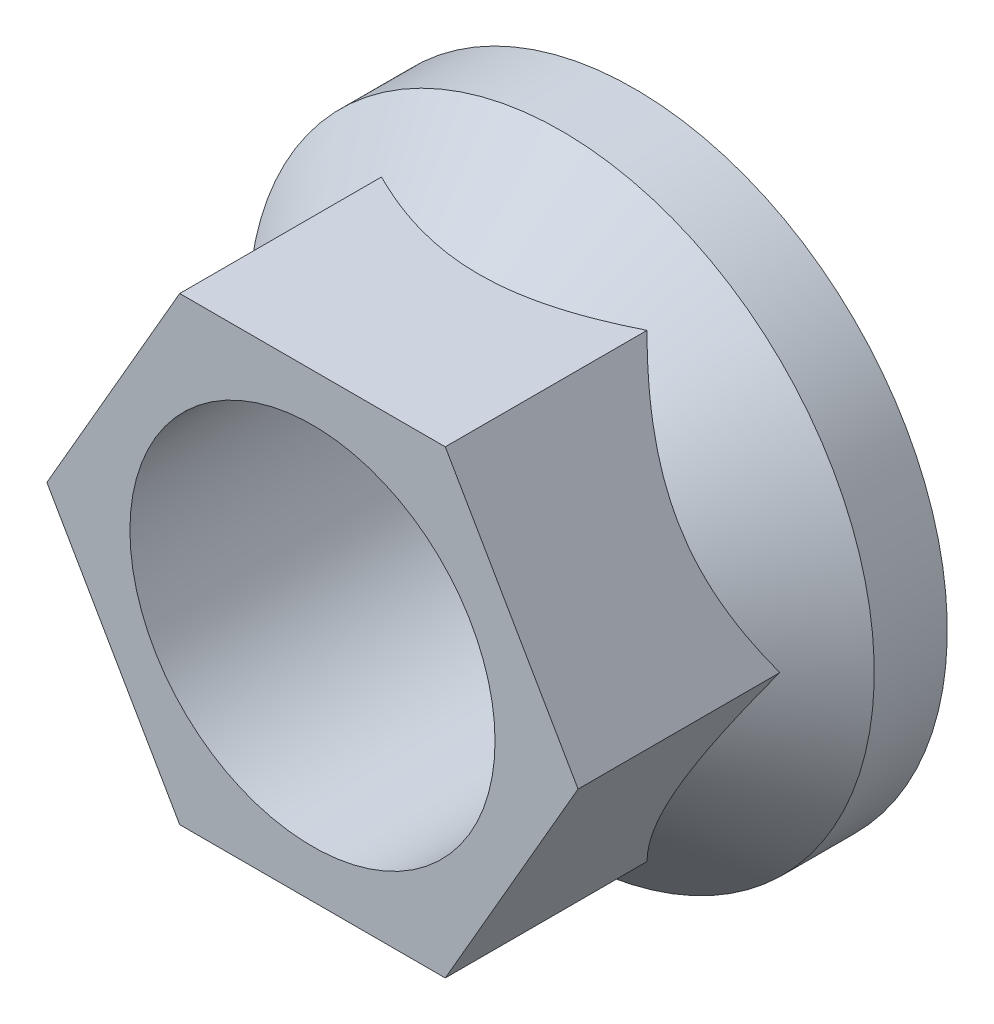
ISO-10303-21;
HEADER;
FILE_DESCRIPTION(('STEP AP214'),'2;1');
FILE_NAME('part.step','',(''),(''),'','','');
FILE_SCHEMA(('AUTOMOTIVE_DESIGN { 1 0 10303 214 1 1 1 1 }'));
ENDSEC;
DATA;
#1=APPLICATION_CONTEXT('core data for automotive mechanical design processes');
#2=APPLICATION_PROTOCOL_DEFINITION('international standard','automotive_design',2000,#1);
#3=PRODUCT_CONTEXT('',#1,'mechanical');
#4=PRODUCT('Part','Part','',(#3));
#5=PRODUCT_RELATED_PRODUCT_CATEGORY('part','',(#4));
#6=PRODUCT_DEFINITION_FORMATION('','',#4);
#7=PRODUCT_DEFINITION_CONTEXT('part definition',#1,'design');
#8=PRODUCT_DEFINITION('design','',#6,#7);
#9=PRODUCT_DEFINITION_SHAPE('','',#8);
#10=(LENGTH_UNIT() NAMED_UNIT(*) SI_UNIT(.MILLI.,.METRE.));
#11=(NAMED_UNIT(*) PLANE_ANGLE_UNIT() SI_UNIT($,.RADIAN.));
#12=(NAMED_UNIT(*) SI_UNIT($,.STERADIAN.) SOLID_ANGLE_UNIT());
#13=UNCERTAINTY_MEASURE_WITH_UNIT(LENGTH_MEASURE(1.E-05),#10,'distance_accuracy_value','');
#14=(GEOMETRIC_REPRESENTATION_CONTEXT(3) GLOBAL_UNCERTAINTY_ASSIGNED_CONTEXT((#13)) GLOBAL_UNIT_ASSIGNED_CONTEXT((#10,
#11,#12)) REPRESENTATION_CONTEXT('',''));
#15=CARTESIAN_POINT('',(0.,0.,0.));
#16=DIRECTION('',(0.,0.,1.));
#17=DIRECTION('',(1.,0.,0.));
#18=AXIS2_PLACEMENT_3D('',#15,#16,#17);
#19=CARTESIAN_POINT('',(0.,3.96875,7.));
#20=DIRECTION('',(0.,0.,1.));
#21=DIRECTION('',(1.,0.,0.));
#22=AXIS2_PLACEMENT_3D('',#19,#20,#21);
#23=PLANE('',#22);
#24=CARTESIAN_POINT('',(0.,0.,7.));
#25=DIRECTION('',(0.,0.,-1.));
#26=DIRECTION('',(-1.,0.,0.));
#27=AXIS2_PLACEMENT_3D('',#24,#25,#26);
#28=CIRCLE('',#27,3.96875);
#29=CARTESIAN_POINT('',(-3.96875,0.,7.));
#30=VERTEX_POINT('',#29);
#31=EDGE_CURVE('E136',#30,#30,#28,.T.);
#32=ORIENTED_EDGE('',*,*,#31,.T.);
#33=EDGE_LOOP('',(#32));
#34=FACE_BOUND('',#33,.T.);
#35=DIRECTION('',(-1.,0.,0.));
#36=VECTOR('',#35,1.);
#37=CARTESIAN_POINT('',(2.88675134594813,5.,7.));
#38=LINE('',#37,#36);
#39=CARTESIAN_POINT('',(2.88675134594813,5.,7.));
#40=VERTEX_POINT('',#39);
#41=CARTESIAN_POINT('',(-2.88675134594813,5.,7.));
#42=VERTEX_POINT('',#41);
#43=EDGE_CURVE('E92',#40,#42,#38,.T.);
#44=ORIENTED_EDGE('',*,*,#43,.T.);
#45=DIRECTION('',(-0.5,-0.866025403784439,0.));
#46=VECTOR('',#45,1.);
#47=CARTESIAN_POINT('',(-2.88675134594813,5.,7.));
#48=LINE('',#47,#46);
#49=CARTESIAN_POINT('',(-5.77350269189626,0.,7.));
#50=VERTEX_POINT('',#49);
#51=EDGE_CURVE('E101',#42,#50,#48,.T.);
#52=ORIENTED_EDGE('',*,*,#51,.T.);
#53=DIRECTION('',(0.5,-0.866025403784439,0.));
#54=VECTOR('',#53,1.);
#55=CARTESIAN_POINT('',(-5.77350269189626,0.,7.));
#56=LINE('',#55,#54);
#57=CARTESIAN_POINT('',(-2.88675134594813,-5.,7.));
#58=VERTEX_POINT('',#57);
#59=EDGE_CURVE('E106',#50,#58,#56,.T.);
#60=ORIENTED_EDGE('',*,*,#59,.T.);
#61=DIRECTION('',(1.,0.,0.));
#62=VECTOR('',#61,1.);
#63=CARTESIAN_POINT('',(-2.88675134594813,-5.,7.));
#64=LINE('',#63,#62);
#65=CARTESIAN_POINT('',(2.88675134594813,-5.,7.));
#66=VERTEX_POINT('',#65);
#67=EDGE_CURVE('E121',#58,#66,#64,.T.);
#68=ORIENTED_EDGE('',*,*,#67,.T.);
#69=DIRECTION('',(0.5,0.866025403784439,0.));
#70=VECTOR('',#69,1.);
#71=CARTESIAN_POINT('',(2.88675134594813,-5.,7.));
#72=LINE('',#71,#70);
#73=CARTESIAN_POINT('',(5.77350269189626,0.,7.));
#74=VERTEX_POINT('',#73);
#75=EDGE_CURVE('E124',#66,#74,#72,.T.);
#76=ORIENTED_EDGE('',*,*,#75,.T.);
#77=DIRECTION('',(-0.5,0.866025403784439,0.));
#78=VECTOR('',#77,1.);
#79=CARTESIAN_POINT('',(5.77350269189626,0.,7.));
#80=LINE('',#79,#78);
#81=EDGE_CURVE('E98',#74,#40,#80,.T.);
#82=ORIENTED_EDGE('',*,*,#81,.T.);
#83=EDGE_LOOP('',(#44,#52,#60,#68,#76,#82));
#84=FACE_BOUND('',#83,.T.);
#85=ADVANCED_FACE('F36',(#34,#84),#23,.T.);
#86=CARTESIAN_POINT('',(0.,0.,1.5875));
#87=DIRECTION('',(0.,0.,-1.));
#88=DIRECTION('',(-1.,0.,0.));
#89=AXIS2_PLACEMENT_3D('',#86,#87,#88);
#90=CONICAL_SURFACE('',#89,6.8,0.78539816339745);
#91=CARTESIAN_POINT('',(-5.7736181619501,-0.00019999999999992,2.61388183458587));
#92=CARTESIAN_POINT('',(-5.72398176110226,0.0857727681733075,2.66351376249948));
#93=CARTESIAN_POINT('',(-5.6739638280717,0.172406369471809,2.71162258281683));
#94=CARTESIAN_POINT('',(-5.57309004377304,0.34712488902884,2.80433067677396));
#95=CARTESIAN_POINT('',(-5.5222337529357,0.43521056864361,2.84892803360225));
#96=CARTESIAN_POINT('',(-5.367822577439,0.702658569860331,2.97713823597548));
#97=CARTESIAN_POINT('',(-5.26296050943972,0.88428499942183,3.05462224260221));
#98=CARTESIAN_POINT('',(-5.05149774994706,1.25054924277183,3.18730836367822));
#99=CARTESIAN_POINT('',(-4.94495110937142,1.43509343762461,3.2428447674579));
#100=CARTESIAN_POINT('',(-4.78337944338746,1.71494377217238,3.30708681405622));
#101=CARTESIAN_POINT('',(-4.72928433986568,1.8086392399128,3.3253151447651));
#102=CARTESIAN_POINT('',(-4.6206360917956,1.99682352572354,3.35500512097761));
#103=CARTESIAN_POINT('',(-4.56608301694086,2.09131222308106,3.36646777779865));
#104=CARTESIAN_POINT('',(-4.43314578685873,2.32156625980078,3.38568644635775));
#105=CARTESIAN_POINT('',(-4.35461839928598,2.45757968486243,3.38971901984402));
#106=CARTESIAN_POINT('',(-4.19770514602325,2.7293614118944,3.38295145399842));
#107=CARTESIAN_POINT('',(-4.11931933958609,2.86512961123583,3.37214611513274));
#108=CARTESIAN_POINT('',(-3.9632867222645,3.13538603207476,3.33633965820569));
#109=CARTESIAN_POINT('',(-3.88564083675503,3.26987265077585,3.31132266414547));
#110=CARTESIAN_POINT('',(-3.73168360440634,3.53653439939647,3.2484529831143));
#111=CARTESIAN_POINT('',(-3.65537215571135,3.66870970573538,3.21060128033617));
#112=CARTESIAN_POINT('',(-3.51990355411976,3.90334820652232,3.13272742134319));
#113=CARTESIAN_POINT('',(-3.46044647368859,4.0063308906988,3.09475305768471));
#114=CARTESIAN_POINT('',(-3.34259967462161,4.21044753419218,3.01268468192979));
#115=CARTESIAN_POINT('',(-3.28420998845894,4.31158143726392,2.96859048400018));
#116=CARTESIAN_POINT('',(-3.16868188148908,4.51168198823798,2.87527092275137));
#117=CARTESIAN_POINT('',(-3.11154017495448,4.61065432718709,2.82606169539434));
#118=CARTESIAN_POINT('',(-2.99831490663731,4.80676624461304,2.72315818526073));
#119=CARTESIAN_POINT('',(-2.94223072132829,4.90390690306938,2.66946665355471));
#120=CARTESIAN_POINT('',(-2.88663587589429,5.0002,2.61388183458587));
#121=B_SPLINE_CURVE_WITH_KNOTS('',3,(#91,#92,#93,#94,#95,#96,#97,#98,#99,#100,#101,#102,#103,
#104,#105,#106,#107,#108,#109,#110,#111,#112,#113,#114,#115,#116,#117,#118,#119,#120),
.UNSPECIFIED.,.F.,.F.,(4,2,2,2,2,2,2,2,2,2,2,2,2,2,4),(0.,0.332945616209568,0.666071736106991,
1.33592065243334,1.99513262597482,2.32409207808824,2.65300234563691,3.12358963991984,
3.59434188052354,4.06562104077027,4.53686407049611,4.91117956742317,5.2855064331967,
5.65868635377115,6.03163889109472),.UNSPECIFIED.);
#122=CARTESIAN_POINT('',(-5.77350269189626,0.,2.61399730810374));
#123=VERTEX_POINT('',#122);
#124=CARTESIAN_POINT('',(-2.88675134594813,5.,2.61399730810374));
#125=VERTEX_POINT('',#124);
#126=EDGE_CURVE('E140',#123,#125,#121,.T.);
#127=ORIENTED_EDGE('',*,*,#126,.T.);
#128=CARTESIAN_POINT('',(-7.20684268333673,5.,-0.383964043269181));
#129=CARTESIAN_POINT('',(-7.02533584783272,5.,-0.234871602398767));
#130=CARTESIAN_POINT('',(-6.84295884941852,5.,-0.0868218638032089));
#131=CARTESIAN_POINT('',(-6.47601907638765,5.,0.206637299933018));
#132=CARTESIAN_POINT('',(-6.29145575829076,5.,0.35204604480556));
#133=CARTESIAN_POINT('',(-5.91774347662376,5.,0.641175063616988));
#134=CARTESIAN_POINT('',(-5.72856639729863,5.,0.784859115566647));
#135=CARTESIAN_POINT('',(-5.34709488465153,5.,1.06800052762655));
#136=CARTESIAN_POINT('',(-5.15480075670416,5.,1.20745829798645));
#137=CARTESIAN_POINT('',(-4.74828785789455,5.,1.49377203808166));
#138=CARTESIAN_POINT('',(-4.53369778406278,5.,1.64010380565186));
#139=CARTESIAN_POINT('',(-4.09882280903799,5.,1.92427880652764));
#140=CARTESIAN_POINT('',(-3.87853606185851,5.,2.06211923804332));
#141=CARTESIAN_POINT('',(-3.43208969458754,5.,2.32557885644554));
#142=CARTESIAN_POINT('',(-3.20596216087672,5.,2.45125191150979));
#143=CARTESIAN_POINT('',(-2.7456402336395,5.,2.68667066325972));
#144=CARTESIAN_POINT('',(-2.51145309302816,5.,2.79643023966708));
#145=CARTESIAN_POINT('',(-2.10332797090163,5.,2.96529770024876));
#146=CARTESIAN_POINT('',(-1.93166126919297,5.,3.02985543617625));
#147=CARTESIAN_POINT('',(-1.5836731379951,5.,3.14525890409372));
#148=CARTESIAN_POINT('',(-1.40735104713127,5.,3.1961026761562));
#149=CARTESIAN_POINT('',(-1.05421412357262,5.,3.28038821967951));
#150=CARTESIAN_POINT('',(-0.877478089032206,5.,3.31415444612165));
#151=CARTESIAN_POINT('',(-0.521464449999362,5.,3.36346766636841));
#152=CARTESIAN_POINT('',(-0.342187457595268,5.,3.37901897491136));
#153=CARTESIAN_POINT('',(0.00824609668831101,5.,3.39041051498121));
#154=CARTESIAN_POINT('',(0.179372606687934,5.,3.38717443039007));
#155=CARTESIAN_POINT('',(0.520399004844326,5.,3.36337145447053));
#156=CARTESIAN_POINT('',(0.690298849003054,5.,3.34280394458272));
#157=CARTESIAN_POINT('',(1.0287130005671,5.,3.28552175283438));
#158=CARTESIAN_POINT('',(1.19720505930835,5.,3.24867809251528));
#159=CARTESIAN_POINT('',(1.53047572651633,5.,3.16098339628438));
#160=CARTESIAN_POINT('',(1.69525363009853,5.,3.11012972532152));
#161=CARTESIAN_POINT('',(2.02014513075725,5.,2.99696570970446));
#162=CARTESIAN_POINT('',(2.18027266869218,5.,2.93469486248416));
#163=CARTESIAN_POINT('',(2.49655833978531,5.,2.80070603826635));
#164=CARTESIAN_POINT('',(2.65271487839687,5.,2.72898433558749));
#165=CARTESIAN_POINT('',(2.96150057332792,5.,2.57782421611012));
#166=CARTESIAN_POINT('',(3.11412423256131,5.,2.49837465894926));
#167=CARTESIAN_POINT('',(3.41597100743156,5.,2.33333668834199));
#168=CARTESIAN_POINT('',(3.5651945226723,5.,2.24774900123765));
#169=CARTESIAN_POINT('',(3.86264486278974,5.,2.07041370144223));
#170=CARTESIAN_POINT('',(4.01083137662813,5.,1.9785987896325));
#171=CARTESIAN_POINT('',(4.30453975295172,5.,1.79081021954944));
#172=CARTESIAN_POINT('',(4.450061554748,5.,1.69483646672549));
#173=CARTESIAN_POINT('',(4.73865434683265,5.,1.49957076621414));
#174=CARTESIAN_POINT('',(4.88172752266474,5.,1.40028203909378));
#175=CARTESIAN_POINT('',(5.16586578389749,5.,1.19888884074802));
#176=CARTESIAN_POINT('',(5.30693093866263,5.,1.0967844671451));
#177=CARTESIAN_POINT('',(5.59870626887491,5.,0.881835473508126));
#178=CARTESIAN_POINT('',(5.74926965373197,5.,0.768791903592957));
#179=CARTESIAN_POINT('',(6.04864866788352,5.,0.540411100317346));
#180=CARTESIAN_POINT('',(6.19746425249832,5.,0.425073808523728));
#181=CARTESIAN_POINT('',(6.64168716046466,5.,0.0761658869699936));
#182=CARTESIAN_POINT('',(6.93483878765855,5.,-0.160277077832388));
#183=CARTESIAN_POINT('',(7.5167127425952,5.,-0.638776003833525));
#184=CARTESIAN_POINT('',(7.8054330793097,5.,-0.880834372114013));
#185=CARTESIAN_POINT('',(8.37936241548021,5.,-1.36908626381488));
#186=CARTESIAN_POINT('',(8.66457132332548,5.,-1.61527989472686));
#187=CARTESIAN_POINT('',(9.23282971432231,5.,-2.11135330652402));
#188=CARTESIAN_POINT('',(9.51587331080528,5.,-2.36123981658115));
#189=CARTESIAN_POINT('',(10.0797503356248,5.,-2.86349804759497));
#190=CARTESIAN_POINT('',(10.3605837365856,5.,-3.11586979924743));
#191=CARTESIAN_POINT('',(10.920382245605,5.,-3.62252028115007));
#192=CARTESIAN_POINT('',(11.1993478479639,5.,-3.87679846579686));
#193=CARTESIAN_POINT('',(11.755810505856,5.,-4.38695739484843));
#194=CARTESIAN_POINT('',(12.0333075558994,5.,-4.64283814523622));
#195=CARTESIAN_POINT('',(12.8012247838068,5.,-5.35429995427943));
#196=CARTESIAN_POINT('',(13.2903452503295,5.,-5.81128360107441));
#197=CARTESIAN_POINT('',(14.2658249043522,5.,-6.7282608026559));
#198=CARTESIAN_POINT('',(14.7521838690041,5.,-7.18825459408499));
#199=CARTESIAN_POINT('',(15.7208582314195,5.,-8.10863801113465));
#200=CARTESIAN_POINT('',(16.2031820166547,5.,-8.56901881612833));
#201=CARTESIAN_POINT('',(17.1661285582923,5.,-9.4914643599497));
#202=CARTESIAN_POINT('',(17.6467514732382,5.,-9.95352893321876));
#203=CARTESIAN_POINT('',(18.1267697042408,5.,-10.4162171833279));
#204=B_SPLINE_CURVE_WITH_KNOTS('',3,(#128,#129,#130,#131,#132,#133,#134,#135,#136,#137,#138,
#139,#140,#141,#142,#143,#144,#145,#146,#147,#148,#149,#150,#151,#152,#153,#154,#155,#156,#157,
#158,#159,#160,#161,#162,#163,#164,#165,#166,#167,#168,#169,#170,#171,#172,#173,#174,#175,#176,
#177,#178,#179,#180,#181,#182,#183,#184,#185,#186,#187,#188,#189,#190,#191,#192,#193,#194,#195,
#196,#197,#198,#199,#200,#201,#202,#203),.UNSPECIFIED.,.F.,.F.,(4,2,2,2,2,2,2,2,2,2,2,2,2,2,2,2,
2,2,2,2,2,2,2,2,2,2,2,2,2,2,2,2,2,2,2,2,2,4),(0.,0.704681621091579,1.40954225127929,
2.12216418418013,2.83471671908357,3.61376913385487,4.39307724186671,5.16876015340873,
5.94376239165213,6.4935186872698,7.04335350958292,7.58230774197345,8.12113428138719,
8.63370109577989,9.14628620448172,9.66300820682658,10.1798274624543,10.6948914210485,
11.210159037123,11.7261807862798,12.2421415735738,12.765032827809,13.2879359761415,
13.8103451056244,14.3327361451554,14.8975398871074,15.4623580360636,16.5921134146673,
17.7223623617099,18.8526407339384,19.9853242974614,21.1180218685947,22.25040678606,
23.3827959336859,25.3909239343666,27.3992117474587,29.3995270305069,31.3996506691803),.UNSPECIFIED.);
#205=CARTESIAN_POINT('',(2.88675134594813,5.,2.61399730810374));
#206=VERTEX_POINT('',#205);
#207=EDGE_CURVE('E94',#125,#206,#204,.T.);
#208=ORIENTED_EDGE('',*,*,#207,.T.);
#209=CARTESIAN_POINT('',(2.88663587589429,5.0002,2.61388183458587));
#210=CARTESIAN_POINT('',(2.93627227674213,4.91422723182669,2.66351376249948));
#211=CARTESIAN_POINT('',(2.98629020977269,4.82759363052819,2.71162258281683));
#212=CARTESIAN_POINT('',(3.08716399407135,4.65287511097116,2.80433067677396));
#213=CARTESIAN_POINT('',(3.13802028490869,4.56478943135639,2.84892803360225));
#214=CARTESIAN_POINT('',(3.29243146040539,4.29734143013967,2.97713823597548));
#215=CARTESIAN_POINT('',(3.39729352840467,4.11571500057817,3.05462224260221));
#216=CARTESIAN_POINT('',(3.60875628789733,3.74945075722818,3.18730836367822));
#217=CARTESIAN_POINT('',(3.71530292847296,3.56490656237539,3.2428447674579));
#218=CARTESIAN_POINT('',(3.87687459445693,3.28505622782762,3.30708681405622));
#219=CARTESIAN_POINT('',(3.93096969797871,3.1913607600872,3.3253151447651));
#220=CARTESIAN_POINT('',(4.03961794604879,3.00317647427647,3.35500512097761));
#221=CARTESIAN_POINT('',(4.09417102090353,2.90868777691895,3.36646777779865));
#222=CARTESIAN_POINT('',(4.22710825098566,2.67843374019922,3.38568644635775));
#223=CARTESIAN_POINT('',(4.30563563855841,2.54242031513757,3.38971901984402));
#224=CARTESIAN_POINT('',(4.46254889182114,2.2706385881056,3.38295145399842));
#225=CARTESIAN_POINT('',(4.5409346982583,2.13487038876417,3.37214611513273));
#226=CARTESIAN_POINT('',(4.69696731557988,1.86461396792524,3.33633965820569));
#227=CARTESIAN_POINT('',(4.77461320108936,1.73012734922415,3.31132266414547));
#228=CARTESIAN_POINT('',(4.92857043343805,1.46346560060353,3.2484529831143));
#229=CARTESIAN_POINT('',(5.00488188213304,1.33129029426463,3.21060128033617));
#230=CARTESIAN_POINT('',(5.14035048372463,1.09665179347768,3.13272742134319));
#231=CARTESIAN_POINT('',(5.1998075641558,0.993669109301201,3.09475305768471));
#232=CARTESIAN_POINT('',(5.31765436322278,0.789552465807827,3.01268468192979));
#233=CARTESIAN_POINT('',(5.37604404938545,0.688418562736079,2.96859048400018));
#234=CARTESIAN_POINT('',(5.49157215635531,0.488318011762025,2.87527092275137));
#235=CARTESIAN_POINT('',(5.54871386288991,0.389345672812909,2.82606169539434));
#236=CARTESIAN_POINT('',(5.66193913120708,0.193233755386958,2.72315818526073));
#237=CARTESIAN_POINT('',(5.7180233165161,0.0960930969306195,2.66946665355471));
#238=CARTESIAN_POINT('',(5.7736181619501,-0.000199999999998285,2.61388183458587));
#239=B_SPLINE_CURVE_WITH_KNOTS('',3,(#209,#210,#211,#212,#213,#214,#215,#216,#217,#218,#219,
#220,#221,#222,#223,#224,#225,#226,#227,#228,#229,#230,#231,#232,#233,#234,#235,#236,#237,#238),
.UNSPECIFIED.,.F.,.F.,(4,2,2,2,2,2,2,2,2,2,2,2,2,2,4),(0.,0.332945616209567,0.666071736106991,
1.33592065243334,1.99513262597481,2.32409207808824,2.65300234563691,3.12358963991983,
3.59434188052354,4.06562104077027,4.53686407049611,4.91117956742317,5.2855064331967,
5.65868635377115,6.03163889109472),.UNSPECIFIED.);
#240=CARTESIAN_POINT('',(5.77350269189626,0.,2.61399730810374));
#241=VERTEX_POINT('',#240);
#242=EDGE_CURVE('E211',#206,#241,#239,.T.);
#243=ORIENTED_EDGE('',*,*,#242,.T.);
#244=CARTESIAN_POINT('',(5.7736181619501,0.000200000000001849,2.61388183458587));
#245=CARTESIAN_POINT('',(5.72398176110226,-0.0857727681733054,2.66351376249948));
#246=CARTESIAN_POINT('',(5.6739638280717,-0.172406369471807,2.71162258281683));
#247=CARTESIAN_POINT('',(5.57309004377304,-0.347124889028838,2.80433067677396));
#248=CARTESIAN_POINT('',(5.5222337529357,-0.435210568643608,2.84892803360225));
#249=CARTESIAN_POINT('',(5.367822577439,-0.702658569860329,2.97713823597548));
#250=CARTESIAN_POINT('',(5.26296050943972,-0.884284999421828,3.05462224260222));
#251=CARTESIAN_POINT('',(5.05149774994706,-1.25054924277182,3.18730836367822));
#252=CARTESIAN_POINT('',(4.94495110937142,-1.43509343762461,3.2428447674579));
#253=CARTESIAN_POINT('',(4.78337944338746,-1.71494377217238,3.30708681405622));
#254=CARTESIAN_POINT('',(4.72928433986568,-1.8086392399128,3.3253151447651));
#255=CARTESIAN_POINT('',(4.6206360917956,-1.99682352572353,3.35500512097761));
#256=CARTESIAN_POINT('',(4.56608301694086,-2.09131222308105,3.36646777779865));
#257=CARTESIAN_POINT('',(4.43314578685873,-2.32156625980078,3.38568644635775));
#258=CARTESIAN_POINT('',(4.35461839928598,-2.45757968486243,3.38971901984402));
#259=CARTESIAN_POINT('',(4.19770514602325,-2.7293614118944,3.38295145399842));
#260=CARTESIAN_POINT('',(4.11931933958609,-2.86512961123582,3.37214611513274));
#261=CARTESIAN_POINT('',(3.9632867222645,-3.13538603207476,3.3363396582057));
#262=CARTESIAN_POINT('',(3.88564083675503,-3.26987265077584,3.31132266414547));
#263=CARTESIAN_POINT('',(3.73168360440634,-3.53653439939646,3.2484529831143));
#264=CARTESIAN_POINT('',(3.65537215571135,-3.66870970573537,3.21060128033617));
#265=CARTESIAN_POINT('',(3.51990355411976,-3.90334820652231,3.1327274213432));
#266=CARTESIAN_POINT('',(3.46044647368859,-4.0063308906988,3.09475305768472));
#267=CARTESIAN_POINT('',(3.34259967462161,-4.21044753419217,3.01268468192979));
#268=CARTESIAN_POINT('',(3.28420998845894,-4.31158143726392,2.96859048400018));
#269=CARTESIAN_POINT('',(3.16868188148908,-4.51168198823797,2.87527092275137));
#270=CARTESIAN_POINT('',(3.11154017495448,-4.61065432718709,2.82606169539434));
#271=CARTESIAN_POINT('',(2.99831490663731,-4.80676624461304,2.72315818526073));
#272=CARTESIAN_POINT('',(2.94223072132829,-4.90390690306938,2.66946665355472));
#273=CARTESIAN_POINT('',(2.88663587589429,-5.0002,2.61388183458587));
#274=B_SPLINE_CURVE_WITH_KNOTS('',3,(#244,#245,#246,#247,#248,#249,#250,#251,#252,#253,#254,
#255,#256,#257,#258,#259,#260,#261,#262,#263,#264,#265,#266,#267,#268,#269,#270,#271,#272,#273),
.UNSPECIFIED.,.F.,.F.,(4,2,2,2,2,2,2,2,2,2,2,2,2,2,4),(0.,0.332945616209569,0.666071736106992,
1.33592065243334,1.99513262597482,2.32409207808824,2.65300234563691,3.12358963991983,
3.59434188052354,4.06562104077027,4.53686407049611,4.91117956742317,5.2855064331967,
5.65868635377115,6.03163889109472),.UNSPECIFIED.);
#275=CARTESIAN_POINT('',(2.88675134594813,-5.,2.61399730810374));
#276=VERTEX_POINT('',#275);
#277=EDGE_CURVE('E206',#241,#276,#274,.T.);
#278=ORIENTED_EDGE('',*,*,#277,.T.);
#279=CARTESIAN_POINT('',(-7.20684268333675,-5.,-0.383964043269188));
#280=CARTESIAN_POINT('',(-7.02533584783273,-5.,-0.234871602398773));
#281=CARTESIAN_POINT('',(-6.84295884941853,-5.,-0.0868218638032146));
#282=CARTESIAN_POINT('',(-6.47601907638766,-5.,0.206637299933013));
#283=CARTESIAN_POINT('',(-6.29145575829077,-5.,0.352046044805554));
#284=CARTESIAN_POINT('',(-5.91774347662377,-5.,0.641175063616982));
#285=CARTESIAN_POINT('',(-5.72856639729864,-5.,0.784859115566641));
#286=CARTESIAN_POINT('',(-5.34709488465154,-5.,1.06800052762655));
#287=CARTESIAN_POINT('',(-5.15480075670417,-5.,1.20745829798645));
#288=CARTESIAN_POINT('',(-4.74828785789456,-5.,1.49377203808166));
#289=CARTESIAN_POINT('',(-4.53369778406279,-5.,1.64010380565186));
#290=CARTESIAN_POINT('',(-4.098822809038,-5.,1.92427880652763));
#291=CARTESIAN_POINT('',(-3.87853606185852,-5.,2.06211923804332));
#292=CARTESIAN_POINT('',(-3.43208969458754,-5.,2.32557885644554));
#293=CARTESIAN_POINT('',(-3.20596216087672,-5.,2.45125191150979));
#294=CARTESIAN_POINT('',(-2.7456402336395,-5.,2.68667066325972));
#295=CARTESIAN_POINT('',(-2.51145309302817,-5.,2.79643023966708));
#296=CARTESIAN_POINT('',(-2.10332797090163,-5.,2.96529770024877));
#297=CARTESIAN_POINT('',(-1.93166126919298,-5.,3.02985543617625));
#298=CARTESIAN_POINT('',(-1.58367313799511,-5.,3.14525890409372));
#299=CARTESIAN_POINT('',(-1.40735104713128,-5.,3.1961026761562));
#300=CARTESIAN_POINT('',(-1.05421412357263,-5.,3.28038821967951));
#301=CARTESIAN_POINT('',(-0.877478089032207,-5.,3.31415444612165));
#302=CARTESIAN_POINT('',(-0.521464449999363,-5.,3.36346766636841));
#303=CARTESIAN_POINT('',(-0.342187457595268,-5.,3.37901897491137));
#304=CARTESIAN_POINT('',(0.00824609668830992,-5.,3.39041051498121));
#305=CARTESIAN_POINT('',(0.179372606687932,-5.,3.38717443039007));
#306=CARTESIAN_POINT('',(0.520399004844325,-5.,3.36337145447053));
#307=CARTESIAN_POINT('',(0.690298849003052,-5.,3.34280394458273));
#308=CARTESIAN_POINT('',(1.0287130005671,-5.,3.28552175283439));
#309=CARTESIAN_POINT('',(1.19720505930835,-5.,3.24867809251528));
#310=CARTESIAN_POINT('',(1.53047572651633,-5.,3.16098339628438));
#311=CARTESIAN_POINT('',(1.69525363009853,-5.,3.11012972532153));
#312=CARTESIAN_POINT('',(2.02014513075725,-5.,2.99696570970446));
#313=CARTESIAN_POINT('',(2.18027266869218,-5.,2.93469486248417));
#314=CARTESIAN_POINT('',(2.49655833978531,-5.,2.80070603826635));
#315=CARTESIAN_POINT('',(2.65271487839687,-5.,2.72898433558749));
#316=CARTESIAN_POINT('',(2.96150057332792,-5.,2.57782421611012));
#317=CARTESIAN_POINT('',(3.11412423256131,-5.,2.49837465894926));
#318=CARTESIAN_POINT('',(3.41597100743156,-5.,2.33333668834199));
#319=CARTESIAN_POINT('',(3.5651945226723,-5.,2.24774900123765));
#320=CARTESIAN_POINT('',(3.86264486278974,-5.,2.07041370144224));
#321=CARTESIAN_POINT('',(4.01083137662813,-5.,1.9785987896325));
#322=CARTESIAN_POINT('',(4.30453975295172,-5.,1.79081021954945));
#323=CARTESIAN_POINT('',(4.45006155474799,-5.,1.6948364667255));
#324=CARTESIAN_POINT('',(4.73865434683265,-5.,1.49957076621414));
#325=CARTESIAN_POINT('',(4.88172752266473,-5.,1.40028203909378));
#326=CARTESIAN_POINT('',(5.16586578389748,-5.,1.19888884074802));
#327=CARTESIAN_POINT('',(5.30693093866263,-5.,1.09678446714511));
#328=CARTESIAN_POINT('',(5.59870626887491,-5.,0.881835473508129));
#329=CARTESIAN_POINT('',(5.74926965373197,-5.,0.76879190359296));
#330=CARTESIAN_POINT('',(6.04864866788352,-5.,0.540411100317349));
#331=CARTESIAN_POINT('',(6.19746425249832,-5.,0.425073808523731));
#332=CARTESIAN_POINT('',(6.64168716046466,-5.,0.0761658869699972));
#333=CARTESIAN_POINT('',(6.93483878765855,-5.,-0.160277077832384));
#334=CARTESIAN_POINT('',(7.51671274259519,-5.,-0.63877600383352));
#335=CARTESIAN_POINT('',(7.8054330793097,-5.,-0.880834372114009));
#336=CARTESIAN_POINT('',(8.3793624154802,-5.,-1.36908626381487));
#337=CARTESIAN_POINT('',(8.66457132332548,-5.,-1.61527989472686));
#338=CARTESIAN_POINT('',(9.23282971432231,-5.,-2.11135330652402));
#339=CARTESIAN_POINT('',(9.51587331080528,-5.,-2.36123981658114));
#340=CARTESIAN_POINT('',(10.0797503356248,-5.,-2.86349804759497));
#341=CARTESIAN_POINT('',(10.3605837365856,-5.,-3.11586979924742));
#342=CARTESIAN_POINT('',(10.920382245605,-5.,-3.62252028115007));
#343=CARTESIAN_POINT('',(11.1993478479639,-5.,-3.87679846579686));
#344=CARTESIAN_POINT('',(11.755810505856,-5.,-4.38695739484843));
#345=CARTESIAN_POINT('',(12.0333075558994,-5.,-4.64283814523622));
#346=CARTESIAN_POINT('',(12.8012247838068,-5.,-5.35429995427942));
#347=CARTESIAN_POINT('',(13.2903452503295,-5.,-5.8112836010744));
#348=CARTESIAN_POINT('',(14.2658249043522,-5.,-6.72826080265589));
#349=CARTESIAN_POINT('',(14.7521838690041,-5.,-7.18825459408498));
#350=CARTESIAN_POINT('',(15.7208582314195,-5.,-8.10863801113464));
#351=CARTESIAN_POINT('',(16.2031820166547,-5.,-8.56901881612833));
#352=CARTESIAN_POINT('',(17.1661285582923,-5.,-9.4914643599497));
#353=CARTESIAN_POINT('',(17.6467514732382,-5.,-9.95352893321876));
#354=CARTESIAN_POINT('',(18.1267697042408,-5.,-10.4162171833279));
#355=B_SPLINE_CURVE_WITH_KNOTS('',3,(#279,#280,#281,#282,#283,#284,#285,#286,#287,#288,#289,
#290,#291,#292,#293,#294,#295,#296,#297,#298,#299,#300,#301,#302,#303,#304,#305,#306,#307,#308,
#309,#310,#311,#312,#313,#314,#315,#316,#317,#318,#319,#320,#321,#322,#323,#324,#325,#326,#327,
#328,#329,#330,#331,#332,#333,#334,#335,#336,#337,#338,#339,#340,#341,#342,#343,#344,#345,#346,
#347,#348,#349,#350,#351,#352,#353,#354),.UNSPECIFIED.,.F.,.F.,(4,2,2,2,2,2,2,2,2,2,2,2,2,2,2,2,
2,2,2,2,2,2,2,2,2,2,2,2,2,2,2,2,2,2,2,2,2,4),(0.,0.70468162109158,1.40954225127929,
2.12216418418014,2.83471671908358,3.61376913385488,4.39307724186672,5.16876015340874,
5.94376239165214,6.49351868726981,7.04335350958293,7.58230774197346,8.1211342813872,
8.63370109577991,9.14628620448173,9.66300820682659,10.1798274624543,10.6948914210486,
11.210159037123,11.7261807862798,12.2421415735739,12.765032827809,13.2879359761415,
13.8103451056244,14.3327361451554,14.8975398871074,15.4623580360636,16.5921134146674,
17.7223623617099,18.8526407339384,19.9853242974614,21.1180218685947,22.25040678606,
23.382795933686,25.3909239343666,27.3992117474587,29.3995270305069,31.3996506691803),.UNSPECIFIED.);
#356=CARTESIAN_POINT('',(-2.88675134594813,-5.,2.61399730810374));
#357=VERTEX_POINT('',#356);
#358=EDGE_CURVE('E55',#276,#357,#355,.F.);
#359=ORIENTED_EDGE('',*,*,#358,.T.);
#360=CARTESIAN_POINT('',(-2.8866358758943,-5.0002,2.61388183458587));
#361=CARTESIAN_POINT('',(-2.93627227674213,-4.91422723182669,2.66351376249948));
#362=CARTESIAN_POINT('',(-2.98629020977269,-4.82759363052819,2.71162258281683));
#363=CARTESIAN_POINT('',(-3.08716399407135,-4.65287511097116,2.80433067677396));
#364=CARTESIAN_POINT('',(-3.13802028490869,-4.56478943135639,2.84892803360225));
#365=CARTESIAN_POINT('',(-3.29243146040539,-4.29734143013967,2.97713823597548));
#366=CARTESIAN_POINT('',(-3.39729352840467,-4.11571500057817,3.05462224260221));
#367=CARTESIAN_POINT('',(-3.60875628789733,-3.74945075722818,3.18730836367822));
#368=CARTESIAN_POINT('',(-3.71530292847296,-3.56490656237539,3.2428447674579));
#369=CARTESIAN_POINT('',(-3.87687459445692,-3.28505622782762,3.30708681405622));
#370=CARTESIAN_POINT('',(-3.9309696979787,-3.1913607600872,3.3253151447651));
#371=CARTESIAN_POINT('',(-4.03961794604879,-3.00317647427647,3.35500512097761));
#372=CARTESIAN_POINT('',(-4.09417102090353,-2.90868777691895,3.36646777779865));
#373=CARTESIAN_POINT('',(-4.22710825098566,-2.67843374019922,3.38568644635775));
#374=CARTESIAN_POINT('',(-4.30563563855841,-2.54242031513757,3.38971901984402));
#375=CARTESIAN_POINT('',(-4.46254889182114,-2.27063858810561,3.38295145399842));
#376=CARTESIAN_POINT('',(-4.5409346982583,-2.13487038876418,3.37214611513273));
#377=CARTESIAN_POINT('',(-4.69696731557988,-1.86461396792525,3.33633965820569));
#378=CARTESIAN_POINT('',(-4.77461320108936,-1.73012734922416,3.31132266414547));
#379=CARTESIAN_POINT('',(-4.92857043343805,-1.46346560060354,3.2484529831143));
#380=CARTESIAN_POINT('',(-5.00488188213304,-1.33129029426463,3.21060128033617));
#381=CARTESIAN_POINT('',(-5.14035048372463,-1.09665179347769,3.13272742134319));
#382=CARTESIAN_POINT('',(-5.19980756415579,-0.993669109301204,3.09475305768471));
#383=CARTESIAN_POINT('',(-5.31765436322278,-0.789552465807828,3.01268468192979));
#384=CARTESIAN_POINT('',(-5.37604404938545,-0.68841856273608,2.96859048400018));
#385=CARTESIAN_POINT('',(-5.49157215635531,-0.488318011762025,2.87527092275137));
#386=CARTESIAN_POINT('',(-5.54871386288991,-0.38934567281291,2.82606169539434));
#387=CARTESIAN_POINT('',(-5.66193913120708,-0.193233755386957,2.72315818526073));
#388=CARTESIAN_POINT('',(-5.7180233165161,-0.0960930969306182,2.66946665355471));
#389=CARTESIAN_POINT('',(-5.7736181619501,0.000200000000000076,2.61388183458587));
#390=B_SPLINE_CURVE_WITH_KNOTS('',3,(#360,#361,#362,#363,#364,#365,#366,#367,#368,#369,#370,
#371,#372,#373,#374,#375,#376,#377,#378,#379,#380,#381,#382,#383,#384,#385,#386,#387,#388,#389),
.UNSPECIFIED.,.F.,.F.,(4,2,2,2,2,2,2,2,2,2,2,2,2,2,4),(0.,0.332945616209568,0.666071736106989,
1.33592065243334,1.99513262597481,2.32409207808824,2.6530023456369,3.12358963991983,
3.59434188052353,4.06562104077026,4.5368640704961,4.91117956742316,5.2855064331967,
5.65868635377115,6.03163889109472),.UNSPECIFIED.);
#391=EDGE_CURVE('E50',#357,#123,#390,.T.);
#392=ORIENTED_EDGE('',*,*,#391,.T.);
#393=EDGE_LOOP('',(#127,#208,#243,#278,#359,#392));
#394=FACE_BOUND('',#393,.T.);
#395=CARTESIAN_POINT('',(0.,0.,1.5875));
#396=DIRECTION('',(0.,0.,-1.));
#397=DIRECTION('',(-1.,0.,0.));
#398=AXIS2_PLACEMENT_3D('',#395,#396,#397);
#399=CIRCLE('',#398,6.8);
#400=CARTESIAN_POINT('',(-6.8,0.,1.5875));
#401=VERTEX_POINT('',#400);
#402=EDGE_CURVE('E11',#401,#401,#399,.T.);
#403=ORIENTED_EDGE('',*,*,#402,.F.);
#404=EDGE_LOOP('',(#403));
#405=FACE_BOUND('',#404,.T.);
#406=ADVANCED_FACE('F150',(#394,#405),#90,.T.);
#407=CARTESIAN_POINT('',(0.,0.,0.));
#408=DIRECTION('',(0.,0.,-1.));
#409=DIRECTION('',(-1.,0.,0.));
#410=AXIS2_PLACEMENT_3D('',#407,#408,#409);
#411=CYLINDRICAL_SURFACE('',#410,6.8);
#412=ORIENTED_EDGE('',*,*,#402,.T.);
#413=EDGE_LOOP('',(#412));
#414=FACE_BOUND('',#413,.T.);
#415=CARTESIAN_POINT('',(0.,0.,0.));
#416=DIRECTION('',(0.,0.,-1.));
#417=DIRECTION('',(-1.,0.,0.));
#418=AXIS2_PLACEMENT_3D('',#415,#416,#417);
#419=CIRCLE('',#418,6.8);
#420=CARTESIAN_POINT('',(-6.8,0.,0.));
#421=VERTEX_POINT('',#420);
#422=EDGE_CURVE('E43',#421,#421,#419,.T.);
#423=ORIENTED_EDGE('',*,*,#422,.F.);
#424=EDGE_LOOP('',(#423));
#425=FACE_BOUND('',#424,.T.);
#426=ADVANCED_FACE('F148',(#414,#425),#411,.T.);
#427=CARTESIAN_POINT('',(0.,6.8,0.));
#428=DIRECTION('',(0.,0.,-1.));
#429=DIRECTION('',(-1.,0.,0.));
#430=AXIS2_PLACEMENT_3D('',#427,#428,#429);
#431=PLANE('',#430);
#432=ORIENTED_EDGE('',*,*,#422,.T.);
#433=EDGE_LOOP('',(#432));
#434=FACE_BOUND('',#433,.T.);
#435=CARTESIAN_POINT('',(0.,0.,0.));
#436=DIRECTION('',(0.,0.,-1.));
#437=DIRECTION('',(-1.,0.,0.));
#438=AXIS2_PLACEMENT_3D('',#435,#436,#437);
#439=CIRCLE('',#438,3.96875);
#440=CARTESIAN_POINT('',(-3.96875,0.,0.));
#441=VERTEX_POINT('',#440);
#442=EDGE_CURVE('E139',#441,#441,#439,.T.);
#443=ORIENTED_EDGE('',*,*,#442,.F.);
#444=EDGE_LOOP('',(#443));
#445=FACE_BOUND('',#444,.T.);
#446=ADVANCED_FACE('F145',(#434,#445),#431,.T.);
#447=CARTESIAN_POINT('',(0.,0.,0.));
#448=DIRECTION('',(0.,0.,-1.));
#449=DIRECTION('',(-1.,0.,0.));
#450=AXIS2_PLACEMENT_3D('',#447,#448,#449);
#451=CYLINDRICAL_SURFACE('',#450,3.96875);
#452=ORIENTED_EDGE('',*,*,#31,.F.);
#453=EDGE_LOOP('',(#452));
#454=FACE_BOUND('',#453,.T.);
#455=ORIENTED_EDGE('',*,*,#442,.T.);
#456=EDGE_LOOP('',(#455));
#457=FACE_BOUND('',#456,.T.);
#458=ADVANCED_FACE('F157',(#454,#457),#451,.F.);
#459=CARTESIAN_POINT('',(-2.88675134594813,5.,-0.00100000000000013));
#460=DIRECTION('',(-0.866025403784439,0.5,0.));
#461=DIRECTION('',(-0.5,-0.866025403784439,0.));
#462=AXIS2_PLACEMENT_3D('',#459,#460,#461);
#463=PLANE('',#462);
#464=ORIENTED_EDGE('',*,*,#126,.F.);
#465=DIRECTION('',(0.,0.,1.));
#466=VECTOR('',#465,1.);
#467=CARTESIAN_POINT('',(-5.77350269189626,0.,-0.00100000000000013));
#468=LINE('',#467,#466);
#469=EDGE_CURVE('E97',#123,#50,#468,.T.);
#470=ORIENTED_EDGE('',*,*,#469,.T.);
#471=ORIENTED_EDGE('',*,*,#51,.F.);
#472=DIRECTION('',(0.,0.,1.));
#473=VECTOR('',#472,1.);
#474=CARTESIAN_POINT('',(-2.88675134594813,5.,-0.00100000000000013));
#475=LINE('',#474,#473);
#476=EDGE_CURVE('E87',#125,#42,#475,.T.);
#477=ORIENTED_EDGE('',*,*,#476,.F.);
#478=EDGE_LOOP('',(#464,#470,#471,#477));
#479=FACE_BOUND('',#478,.T.);
#480=ADVANCED_FACE('F102',(#479),#463,.T.);
#481=CARTESIAN_POINT('',(-5.77350269189626,0.,-0.00100000000000013));
#482=DIRECTION('',(-0.866025403784439,-0.5,0.));
#483=DIRECTION('',(0.5,-0.866025403784439,0.));
#484=AXIS2_PLACEMENT_3D('',#481,#482,#483);
#485=PLANE('',#484);
#486=ORIENTED_EDGE('',*,*,#391,.F.);
#487=DIRECTION('',(0.,0.,1.));
#488=VECTOR('',#487,1.);
#489=CARTESIAN_POINT('',(-2.88675134594813,-5.,-0.00100000000000013));
#490=LINE('',#489,#488);
#491=EDGE_CURVE('E133',#357,#58,#490,.T.);
#492=ORIENTED_EDGE('',*,*,#491,.T.);
#493=ORIENTED_EDGE('',*,*,#59,.F.);
#494=ORIENTED_EDGE('',*,*,#469,.F.);
#495=EDGE_LOOP('',(#486,#492,#493,#494));
#496=FACE_BOUND('',#495,.T.);
#497=ADVANCED_FACE('F172',(#496),#485,.T.);
#498=CARTESIAN_POINT('',(-2.88675134594813,-5.,-0.00100000000000013));
#499=DIRECTION('',(0.,-1.,0.));
#500=DIRECTION('',(0.,0.,-1.));
#501=AXIS2_PLACEMENT_3D('',#498,#499,#500);
#502=PLANE('',#501);
#503=ORIENTED_EDGE('',*,*,#358,.F.);
#504=DIRECTION('',(0.,0.,1.));
#505=VECTOR('',#504,1.);
#506=CARTESIAN_POINT('',(2.88675134594813,-5.,-0.00100000000000013));
#507=LINE('',#506,#505);
#508=EDGE_CURVE('E131',#276,#66,#507,.T.);
#509=ORIENTED_EDGE('',*,*,#508,.T.);
#510=ORIENTED_EDGE('',*,*,#67,.F.);
#511=ORIENTED_EDGE('',*,*,#491,.F.);
#512=EDGE_LOOP('',(#503,#509,#510,#511));
#513=FACE_BOUND('',#512,.T.);
#514=ADVANCED_FACE('F224',(#513),#502,.T.);
#515=CARTESIAN_POINT('',(2.88675134594813,-5.,-0.00100000000000013));
#516=DIRECTION('',(0.866025403784439,-0.5,0.));
#517=DIRECTION('',(0.5,0.866025403784439,0.));
#518=AXIS2_PLACEMENT_3D('',#515,#516,#517);
#519=PLANE('',#518);
#520=ORIENTED_EDGE('',*,*,#277,.F.);
#521=DIRECTION('',(0.,0.,1.));
#522=VECTOR('',#521,1.);
#523=CARTESIAN_POINT('',(5.77350269189626,0.,-0.00100000000000013));
#524=LINE('',#523,#522);
#525=EDGE_CURVE('E129',#241,#74,#524,.T.);
#526=ORIENTED_EDGE('',*,*,#525,.T.);
#527=ORIENTED_EDGE('',*,*,#75,.F.);
#528=ORIENTED_EDGE('',*,*,#508,.F.);
#529=EDGE_LOOP('',(#520,#526,#527,#528));
#530=FACE_BOUND('',#529,.T.);
#531=ADVANCED_FACE('F227',(#530),#519,.T.);
#532=CARTESIAN_POINT('',(5.77350269189626,0.,-0.00100000000000013));
#533=DIRECTION('',(0.866025403784439,0.5,0.));
#534=DIRECTION('',(-0.5,0.866025403784439,0.));
#535=AXIS2_PLACEMENT_3D('',#532,#533,#534);
#536=PLANE('',#535);
#537=ORIENTED_EDGE('',*,*,#242,.F.);
#538=DIRECTION('',(0.,0.,1.));
#539=VECTOR('',#538,1.);
#540=CARTESIAN_POINT('',(2.88675134594813,5.,-0.00100000000000013));
#541=LINE('',#540,#539);
#542=EDGE_CURVE('E127',#206,#40,#541,.T.);
#543=ORIENTED_EDGE('',*,*,#542,.T.);
#544=ORIENTED_EDGE('',*,*,#81,.F.);
#545=ORIENTED_EDGE('',*,*,#525,.F.);
#546=EDGE_LOOP('',(#537,#543,#544,#545));
#547=FACE_BOUND('',#546,.T.);
#548=ADVANCED_FACE('F176',(#547),#536,.T.);
#549=CARTESIAN_POINT('',(2.88675134594813,5.,-0.00100000000000013));
#550=DIRECTION('',(0.,1.,0.));
#551=DIRECTION('',(0.,0.,1.));
#552=AXIS2_PLACEMENT_3D('',#549,#550,#551);
#553=PLANE('',#552);
#554=ORIENTED_EDGE('',*,*,#207,.F.);
#555=ORIENTED_EDGE('',*,*,#476,.T.);
#556=ORIENTED_EDGE('',*,*,#43,.F.);
#557=ORIENTED_EDGE('',*,*,#542,.F.);
#558=EDGE_LOOP('',(#554,#555,#556,#557));
#559=FACE_BOUND('',#558,.T.);
#560=ADVANCED_FACE('F89',(#559),#553,.T.);
#561=CLOSED_SHELL('',(#85,#406,#426,#446,#458,#480,#497,#514,#531,#548,#560));
#562=MANIFOLD_SOLID_BREP('B2',#561);
#563=ADVANCED_BREP_SHAPE_REPRESENTATION('',(#18,#562),#14);
#564=SHAPE_DEFINITION_REPRESENTATION(#9,#563);
ENDSEC;
END-ISO-10303-21;
